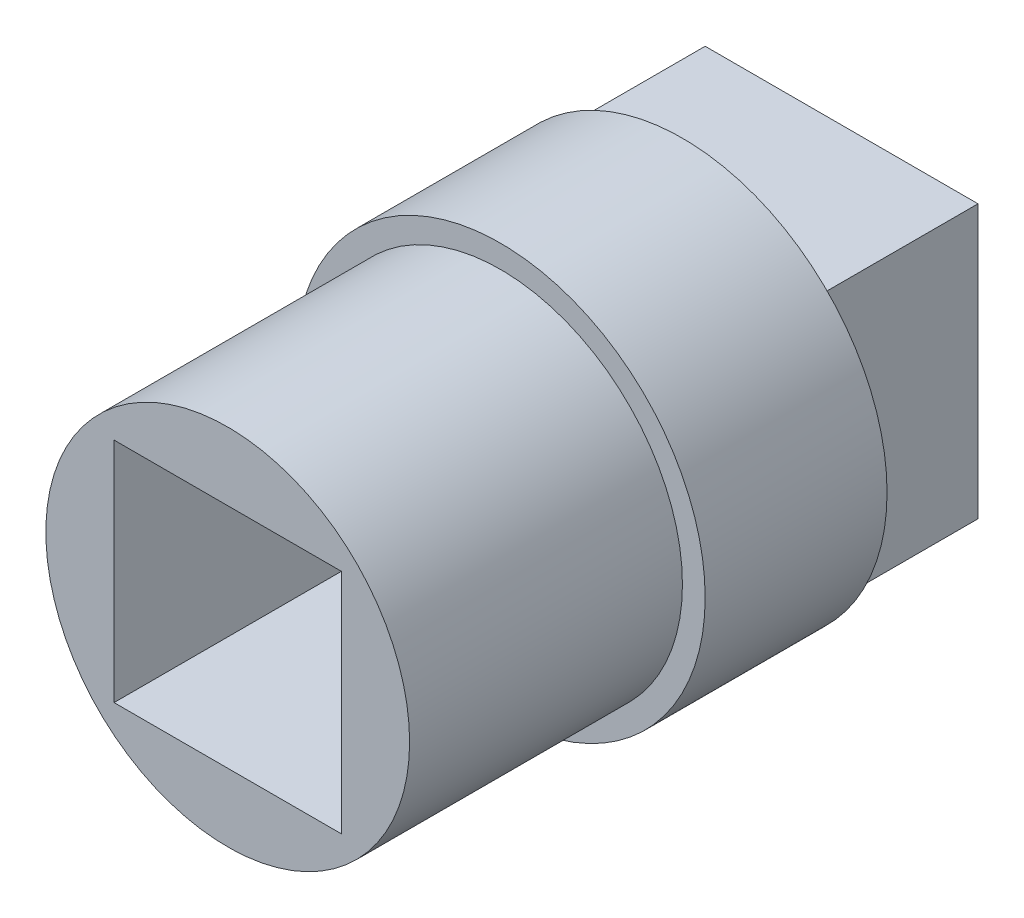
ISO-10303-21;
HEADER;
FILE_DESCRIPTION(('STEP AP214'),'2;1');
FILE_NAME('part.step','',(''),(''),'','','');
FILE_SCHEMA(('AUTOMOTIVE_DESIGN { 1 0 10303 214 1 1 1 1 }'));
ENDSEC;
DATA;
#1=APPLICATION_CONTEXT('core data for automotive mechanical design processes');
#2=APPLICATION_PROTOCOL_DEFINITION('international standard','automotive_design',2000,#1);
#3=PRODUCT_CONTEXT('',#1,'mechanical');
#4=PRODUCT('Part','Part','',(#3));
#5=PRODUCT_RELATED_PRODUCT_CATEGORY('part','',(#4));
#6=PRODUCT_DEFINITION_FORMATION('','',#4);
#7=PRODUCT_DEFINITION_CONTEXT('part definition',#1,'design');
#8=PRODUCT_DEFINITION('design','',#6,#7);
#9=PRODUCT_DEFINITION_SHAPE('','',#8);
#10=(LENGTH_UNIT() NAMED_UNIT(*) SI_UNIT(.MILLI.,.METRE.));
#11=(NAMED_UNIT(*) PLANE_ANGLE_UNIT() SI_UNIT($,.RADIAN.));
#12=(NAMED_UNIT(*) SI_UNIT($,.STERADIAN.) SOLID_ANGLE_UNIT());
#13=UNCERTAINTY_MEASURE_WITH_UNIT(LENGTH_MEASURE(1.E-05),#10,'distance_accuracy_value','');
#14=(GEOMETRIC_REPRESENTATION_CONTEXT(3) GLOBAL_UNCERTAINTY_ASSIGNED_CONTEXT((#13)) GLOBAL_UNIT_ASSIGNED_CONTEXT((#10,
#11,#12)) REPRESENTATION_CONTEXT('',''));
#15=CARTESIAN_POINT('',(0.,0.,0.));
#16=DIRECTION('',(0.,0.,1.));
#17=DIRECTION('',(1.,0.,0.));
#18=AXIS2_PLACEMENT_3D('',#15,#16,#17);
#19=CARTESIAN_POINT('',(3.,-3.,3.5));
#20=DIRECTION('',(-1.,0.,0.));
#21=DIRECTION('',(0.,0.,1.));
#22=AXIS2_PLACEMENT_3D('',#19,#20,#21);
#23=PLANE('',#22);
#24=DIRECTION('',(0.,1.,0.));
#25=VECTOR('',#24,1.);
#26=CARTESIAN_POINT('',(3.,-3.,0.));
#27=LINE('',#26,#25);
#28=CARTESIAN_POINT('',(3.,-3.,0.));
#29=VERTEX_POINT('',#28);
#30=CARTESIAN_POINT('',(3.,3.,0.));
#31=VERTEX_POINT('',#30);
#32=EDGE_CURVE('E157',#29,#31,#27,.T.);
#33=ORIENTED_EDGE('',*,*,#32,.T.);
#34=DIRECTION('',(0.,0.,-1.));
#35=VECTOR('',#34,1.);
#36=CARTESIAN_POINT('',(3.,3.,3.5));
#37=LINE('',#36,#35);
#38=CARTESIAN_POINT('',(3.,3.,3.5));
#39=VERTEX_POINT('',#38);
#40=EDGE_CURVE('E39',#39,#31,#37,.T.);
#41=ORIENTED_EDGE('',*,*,#40,.F.);
#42=DIRECTION('',(0.,1.,0.));
#43=VECTOR('',#42,1.);
#44=CARTESIAN_POINT('',(3.,-3.,3.5));
#45=LINE('',#44,#43);
#46=CARTESIAN_POINT('',(3.,-3.,3.5));
#47=VERTEX_POINT('',#46);
#48=EDGE_CURVE('E160',#47,#39,#45,.T.);
#49=ORIENTED_EDGE('',*,*,#48,.F.);
#50=DIRECTION('',(0.,0.,-1.));
#51=VECTOR('',#50,1.);
#52=CARTESIAN_POINT('',(3.,-3.,3.5));
#53=LINE('',#52,#51);
#54=EDGE_CURVE('E170',#47,#29,#53,.T.);
#55=ORIENTED_EDGE('',*,*,#54,.T.);
#56=EDGE_LOOP('',(#33,#41,#49,#55));
#57=FACE_BOUND('',#56,.T.);
#58=ADVANCED_FACE('F36',(#57),#23,.F.);
#59=CARTESIAN_POINT('',(-3.,3.,3.5));
#60=DIRECTION('',(0.,-1.,0.));
#61=DIRECTION('',(0.,0.,-1.));
#62=AXIS2_PLACEMENT_3D('',#59,#60,#61);
#63=PLANE('',#62);
#64=DIRECTION('',(-1.,0.,0.));
#65=VECTOR('',#64,1.);
#66=CARTESIAN_POINT('',(-3.,3.,0.));
#67=LINE('',#66,#65);
#68=CARTESIAN_POINT('',(-3.,3.,0.));
#69=VERTEX_POINT('',#68);
#70=EDGE_CURVE('E173',#31,#69,#67,.T.);
#71=ORIENTED_EDGE('',*,*,#70,.T.);
#72=DIRECTION('',(0.,0.,-1.));
#73=VECTOR('',#72,1.);
#74=CARTESIAN_POINT('',(-3.,3.,3.5));
#75=LINE('',#74,#73);
#76=CARTESIAN_POINT('',(-3.,3.,3.5));
#77=VERTEX_POINT('',#76);
#78=EDGE_CURVE('E179',#77,#69,#75,.T.);
#79=ORIENTED_EDGE('',*,*,#78,.F.);
#80=DIRECTION('',(-1.,0.,0.));
#81=VECTOR('',#80,1.);
#82=CARTESIAN_POINT('',(-3.,3.,3.5));
#83=LINE('',#82,#81);
#84=EDGE_CURVE('E86',#39,#77,#83,.T.);
#85=ORIENTED_EDGE('',*,*,#84,.F.);
#86=ORIENTED_EDGE('',*,*,#40,.T.);
#87=EDGE_LOOP('',(#71,#79,#85,#86));
#88=FACE_BOUND('',#87,.T.);
#89=ADVANCED_FACE('F182',(#88),#63,.F.);
#90=CARTESIAN_POINT('',(-3.,-3.,3.5));
#91=DIRECTION('',(1.,0.,0.));
#92=DIRECTION('',(0.,0.,-1.));
#93=AXIS2_PLACEMENT_3D('',#90,#91,#92);
#94=PLANE('',#93);
#95=DIRECTION('',(0.,-1.,0.));
#96=VECTOR('',#95,1.);
#97=CARTESIAN_POINT('',(-3.,-3.,0.));
#98=LINE('',#97,#96);
#99=CARTESIAN_POINT('',(-3.,-3.,0.));
#100=VERTEX_POINT('',#99);
#101=EDGE_CURVE('E175',#69,#100,#98,.T.);
#102=ORIENTED_EDGE('',*,*,#101,.T.);
#103=DIRECTION('',(0.,0.,-1.));
#104=VECTOR('',#103,1.);
#105=CARTESIAN_POINT('',(-3.,-3.,3.5));
#106=LINE('',#105,#104);
#107=CARTESIAN_POINT('',(-3.,-3.,3.5));
#108=VERTEX_POINT('',#107);
#109=EDGE_CURVE('E60',#108,#100,#106,.T.);
#110=ORIENTED_EDGE('',*,*,#109,.F.);
#111=DIRECTION('',(0.,-1.,0.));
#112=VECTOR('',#111,1.);
#113=CARTESIAN_POINT('',(-3.,-3.,3.5));
#114=LINE('',#113,#112);
#115=EDGE_CURVE('E164',#77,#108,#114,.T.);
#116=ORIENTED_EDGE('',*,*,#115,.F.);
#117=ORIENTED_EDGE('',*,*,#78,.T.);
#118=EDGE_LOOP('',(#102,#110,#116,#117));
#119=FACE_BOUND('',#118,.T.);
#120=ADVANCED_FACE('F187',(#119),#94,.F.);
#121=CARTESIAN_POINT('',(-3.,-3.,3.5));
#122=DIRECTION('',(0.,1.,0.));
#123=DIRECTION('',(0.,0.,1.));
#124=AXIS2_PLACEMENT_3D('',#121,#122,#123);
#125=PLANE('',#124);
#126=DIRECTION('',(1.,0.,0.));
#127=VECTOR('',#126,1.);
#128=CARTESIAN_POINT('',(-3.,-3.,0.));
#129=LINE('',#128,#127);
#130=EDGE_CURVE('E80',#100,#29,#129,.T.);
#131=ORIENTED_EDGE('',*,*,#130,.T.);
#132=ORIENTED_EDGE('',*,*,#54,.F.);
#133=DIRECTION('',(1.,0.,0.));
#134=VECTOR('',#133,1.);
#135=CARTESIAN_POINT('',(-3.,-3.,3.5));
#136=LINE('',#135,#134);
#137=EDGE_CURVE('E167',#108,#47,#136,.T.);
#138=ORIENTED_EDGE('',*,*,#137,.F.);
#139=ORIENTED_EDGE('',*,*,#109,.T.);
#140=EDGE_LOOP('',(#131,#132,#138,#139));
#141=FACE_BOUND('',#140,.T.);
#142=ADVANCED_FACE('F188',(#141),#125,.F.);
#143=CARTESIAN_POINT('',(0.,0.,0.));
#144=DIRECTION('',(0.,0.,-1.));
#145=DIRECTION('',(-1.,0.,0.));
#146=AXIS2_PLACEMENT_3D('',#143,#144,#145);
#147=PLANE('',#146);
#148=ORIENTED_EDGE('',*,*,#32,.F.);
#149=ORIENTED_EDGE('',*,*,#130,.F.);
#150=ORIENTED_EDGE('',*,*,#101,.F.);
#151=ORIENTED_EDGE('',*,*,#70,.F.);
#152=EDGE_LOOP('',(#148,#149,#150,#151));
#153=FACE_BOUND('',#152,.T.);
#154=ADVANCED_FACE('F186',(#153),#147,.T.);
#155=CARTESIAN_POINT('',(0.,0.,3.5));
#156=DIRECTION('',(0.,0.,1.));
#157=DIRECTION('',(1.,0.,0.));
#158=AXIS2_PLACEMENT_3D('',#155,#156,#157);
#159=PLANE('',#158);
#160=CARTESIAN_POINT('',(0.,0.,3.5));
#161=DIRECTION('',(0.,0.,1.));
#162=DIRECTION('',(1.,0.,0.));
#163=AXIS2_PLACEMENT_3D('',#160,#161,#162);
#164=CIRCLE('',#163,4.5);
#165=CARTESIAN_POINT('',(4.5,0.,3.5));
#166=VERTEX_POINT('',#165);
#167=EDGE_CURVE('E152',#166,#166,#164,.T.);
#168=ORIENTED_EDGE('',*,*,#167,.F.);
#169=EDGE_LOOP('',(#168));
#170=FACE_BOUND('',#169,.T.);
#171=ORIENTED_EDGE('',*,*,#137,.T.);
#172=ORIENTED_EDGE('',*,*,#48,.T.);
#173=ORIENTED_EDGE('',*,*,#84,.T.);
#174=ORIENTED_EDGE('',*,*,#115,.T.);
#175=EDGE_LOOP('',(#171,#172,#173,#174));
#176=FACE_BOUND('',#175,.T.);
#177=ADVANCED_FACE('F190',(#170,#176),#159,.F.);
#178=CARTESIAN_POINT('',(0.,0.,7.5));
#179=DIRECTION('',(0.,0.,-1.));
#180=DIRECTION('',(-1.,0.,0.));
#181=AXIS2_PLACEMENT_3D('',#178,#179,#180);
#182=CYLINDRICAL_SURFACE('',#181,4.5);
#183=CARTESIAN_POINT('',(0.,0.,7.5));
#184=DIRECTION('',(0.,0.,1.));
#185=DIRECTION('',(1.,0.,0.));
#186=AXIS2_PLACEMENT_3D('',#183,#184,#185);
#187=CIRCLE('',#186,4.5);
#188=CARTESIAN_POINT('',(4.5,0.,7.5));
#189=VERTEX_POINT('',#188);
#190=EDGE_CURVE('E154',#189,#189,#187,.T.);
#191=ORIENTED_EDGE('',*,*,#190,.F.);
#192=EDGE_LOOP('',(#191));
#193=FACE_BOUND('',#192,.T.);
#194=ORIENTED_EDGE('',*,*,#167,.T.);
#195=EDGE_LOOP('',(#194));
#196=FACE_BOUND('',#195,.T.);
#197=ADVANCED_FACE('F192',(#193,#196),#182,.T.);
#198=CARTESIAN_POINT('',(0.,0.,7.5));
#199=DIRECTION('',(0.,0.,1.));
#200=DIRECTION('',(1.,0.,0.));
#201=AXIS2_PLACEMENT_3D('',#198,#199,#200);
#202=PLANE('',#201);
#203=CARTESIAN_POINT('',(0.,0.,7.5));
#204=DIRECTION('',(0.,0.,1.));
#205=DIRECTION('',(1.,0.,0.));
#206=AXIS2_PLACEMENT_3D('',#203,#204,#205);
#207=CIRCLE('',#206,4.);
#208=CARTESIAN_POINT('',(4.,0.,7.5));
#209=VERTEX_POINT('',#208);
#210=EDGE_CURVE('E11',#209,#209,#207,.T.);
#211=ORIENTED_EDGE('',*,*,#210,.F.);
#212=EDGE_LOOP('',(#211));
#213=FACE_BOUND('',#212,.T.);
#214=ORIENTED_EDGE('',*,*,#190,.T.);
#215=EDGE_LOOP('',(#214));
#216=FACE_BOUND('',#215,.T.);
#217=ADVANCED_FACE('F199',(#213,#216),#202,.T.);
#218=CARTESIAN_POINT('',(0.,0.,13.5));
#219=DIRECTION('',(0.,0.,-1.));
#220=DIRECTION('',(-1.,0.,0.));
#221=AXIS2_PLACEMENT_3D('',#218,#219,#220);
#222=CYLINDRICAL_SURFACE('',#221,4.);
#223=CARTESIAN_POINT('',(0.,0.,13.5));
#224=DIRECTION('',(0.,0.,1.));
#225=DIRECTION('',(1.,0.,0.));
#226=AXIS2_PLACEMENT_3D('',#223,#224,#225);
#227=CIRCLE('',#226,4.);
#228=CARTESIAN_POINT('',(4.,0.,13.5));
#229=VERTEX_POINT('',#228);
#230=EDGE_CURVE('E147',#229,#229,#227,.T.);
#231=ORIENTED_EDGE('',*,*,#230,.F.);
#232=EDGE_LOOP('',(#231));
#233=FACE_BOUND('',#232,.T.);
#234=ORIENTED_EDGE('',*,*,#210,.T.);
#235=EDGE_LOOP('',(#234));
#236=FACE_BOUND('',#235,.T.);
#237=ADVANCED_FACE('F265',(#233,#236),#222,.T.);
#238=CARTESIAN_POINT('',(0.,0.,13.5));
#239=DIRECTION('',(0.,0.,1.));
#240=DIRECTION('',(1.,0.,0.));
#241=AXIS2_PLACEMENT_3D('',#238,#239,#240);
#242=PLANE('',#241);
#243=DIRECTION('',(0.,1.,0.));
#244=VECTOR('',#243,1.);
#245=CARTESIAN_POINT('',(2.5,-2.5,13.5));
#246=LINE('',#245,#244);
#247=CARTESIAN_POINT('',(2.5,-2.5,13.5));
#248=VERTEX_POINT('',#247);
#249=CARTESIAN_POINT('',(2.5,2.5,13.5));
#250=VERTEX_POINT('',#249);
#251=EDGE_CURVE('E51',#248,#250,#246,.T.);
#252=ORIENTED_EDGE('',*,*,#251,.F.);
#253=DIRECTION('',(1.,0.,0.));
#254=VECTOR('',#253,1.);
#255=CARTESIAN_POINT('',(-2.5,-2.5,13.5));
#256=LINE('',#255,#254);
#257=CARTESIAN_POINT('',(-2.5,-2.5,13.5));
#258=VERTEX_POINT('',#257);
#259=EDGE_CURVE('E132',#258,#248,#256,.T.);
#260=ORIENTED_EDGE('',*,*,#259,.F.);
#261=DIRECTION('',(0.,-1.,0.));
#262=VECTOR('',#261,1.);
#263=CARTESIAN_POINT('',(-2.5,-2.5,13.5));
#264=LINE('',#263,#262);
#265=CARTESIAN_POINT('',(-2.5,2.5,13.5));
#266=VERTEX_POINT('',#265);
#267=EDGE_CURVE('E135',#266,#258,#264,.T.);
#268=ORIENTED_EDGE('',*,*,#267,.F.);
#269=DIRECTION('',(-1.,0.,0.));
#270=VECTOR('',#269,1.);
#271=CARTESIAN_POINT('',(-2.5,2.5,13.5));
#272=LINE('',#271,#270);
#273=EDGE_CURVE('E141',#250,#266,#272,.T.);
#274=ORIENTED_EDGE('',*,*,#273,.F.);
#275=EDGE_LOOP('',(#252,#260,#268,#274));
#276=FACE_BOUND('',#275,.T.);
#277=ORIENTED_EDGE('',*,*,#230,.T.);
#278=EDGE_LOOP('',(#277));
#279=FACE_BOUND('',#278,.T.);
#280=ADVANCED_FACE('F274',(#276,#279),#242,.T.);
#281=CARTESIAN_POINT('',(2.5,-2.5,8.5));
#282=DIRECTION('',(1.,0.,0.));
#283=DIRECTION('',(0.,0.,-1.));
#284=AXIS2_PLACEMENT_3D('',#281,#282,#283);
#285=PLANE('',#284);
#286=ORIENTED_EDGE('',*,*,#251,.T.);
#287=DIRECTION('',(0.,0.,1.));
#288=VECTOR('',#287,1.);
#289=CARTESIAN_POINT('',(2.5,2.5,8.5));
#290=LINE('',#289,#288);
#291=CARTESIAN_POINT('',(2.5,2.5,8.5));
#292=VERTEX_POINT('',#291);
#293=EDGE_CURVE('E110',#292,#250,#290,.T.);
#294=ORIENTED_EDGE('',*,*,#293,.F.);
#295=DIRECTION('',(0.,1.,0.));
#296=VECTOR('',#295,1.);
#297=CARTESIAN_POINT('',(2.5,-2.5,8.5));
#298=LINE('',#297,#296);
#299=CARTESIAN_POINT('',(2.5,-2.5,8.5));
#300=VERTEX_POINT('',#299);
#301=EDGE_CURVE('E114',#300,#292,#298,.T.);
#302=ORIENTED_EDGE('',*,*,#301,.F.);
#303=DIRECTION('',(0.,0.,1.));
#304=VECTOR('',#303,1.);
#305=CARTESIAN_POINT('',(2.5,-2.5,8.5));
#306=LINE('',#305,#304);
#307=EDGE_CURVE('E145',#300,#248,#306,.T.);
#308=ORIENTED_EDGE('',*,*,#307,.T.);
#309=EDGE_LOOP('',(#286,#294,#302,#308));
#310=FACE_BOUND('',#309,.T.);
#311=ADVANCED_FACE('F112',(#310),#285,.F.);
#312=CARTESIAN_POINT('',(-2.5,-2.5,8.5));
#313=DIRECTION('',(0.,-1.,0.));
#314=DIRECTION('',(0.,0.,-1.));
#315=AXIS2_PLACEMENT_3D('',#312,#313,#314);
#316=PLANE('',#315);
#317=ORIENTED_EDGE('',*,*,#259,.T.);
#318=ORIENTED_EDGE('',*,*,#307,.F.);
#319=DIRECTION('',(1.,0.,0.));
#320=VECTOR('',#319,1.);
#321=CARTESIAN_POINT('',(-2.5,-2.5,8.5));
#322=LINE('',#321,#320);
#323=CARTESIAN_POINT('',(-2.5,-2.5,8.5));
#324=VERTEX_POINT('',#323);
#325=EDGE_CURVE('E120',#324,#300,#322,.T.);
#326=ORIENTED_EDGE('',*,*,#325,.F.);
#327=DIRECTION('',(0.,0.,1.));
#328=VECTOR('',#327,1.);
#329=CARTESIAN_POINT('',(-2.5,-2.5,8.5));
#330=LINE('',#329,#328);
#331=EDGE_CURVE('E148',#324,#258,#330,.T.);
#332=ORIENTED_EDGE('',*,*,#331,.T.);
#333=EDGE_LOOP('',(#317,#318,#326,#332));
#334=FACE_BOUND('',#333,.T.);
#335=ADVANCED_FACE('F293',(#334),#316,.F.);
#336=CARTESIAN_POINT('',(-2.5,-2.5,8.5));
#337=DIRECTION('',(-1.,0.,0.));
#338=DIRECTION('',(0.,0.,1.));
#339=AXIS2_PLACEMENT_3D('',#336,#337,#338);
#340=PLANE('',#339);
#341=ORIENTED_EDGE('',*,*,#267,.T.);
#342=ORIENTED_EDGE('',*,*,#331,.F.);
#343=DIRECTION('',(0.,-1.,0.));
#344=VECTOR('',#343,1.);
#345=CARTESIAN_POINT('',(-2.5,-2.5,8.5));
#346=LINE('',#345,#344);
#347=CARTESIAN_POINT('',(-2.5,2.5,8.5));
#348=VERTEX_POINT('',#347);
#349=EDGE_CURVE('E128',#348,#324,#346,.T.);
#350=ORIENTED_EDGE('',*,*,#349,.F.);
#351=DIRECTION('',(0.,0.,1.));
#352=VECTOR('',#351,1.);
#353=CARTESIAN_POINT('',(-2.5,2.5,8.5));
#354=LINE('',#353,#352);
#355=EDGE_CURVE('E119',#348,#266,#354,.T.);
#356=ORIENTED_EDGE('',*,*,#355,.T.);
#357=EDGE_LOOP('',(#341,#342,#350,#356));
#358=FACE_BOUND('',#357,.T.);
#359=ADVANCED_FACE('F302',(#358),#340,.F.);
#360=CARTESIAN_POINT('',(-2.5,2.5,8.5));
#361=DIRECTION('',(0.,1.,0.));
#362=DIRECTION('',(0.,0.,1.));
#363=AXIS2_PLACEMENT_3D('',#360,#361,#362);
#364=PLANE('',#363);
#365=ORIENTED_EDGE('',*,*,#273,.T.);
#366=ORIENTED_EDGE('',*,*,#355,.F.);
#367=DIRECTION('',(-1.,0.,0.));
#368=VECTOR('',#367,1.);
#369=CARTESIAN_POINT('',(-2.5,2.5,8.5));
#370=LINE('',#369,#368);
#371=EDGE_CURVE('E123',#292,#348,#370,.T.);
#372=ORIENTED_EDGE('',*,*,#371,.F.);
#373=ORIENTED_EDGE('',*,*,#293,.T.);
#374=EDGE_LOOP('',(#365,#366,#372,#373));
#375=FACE_BOUND('',#374,.T.);
#376=ADVANCED_FACE('F124',(#375),#364,.F.);
#377=CARTESIAN_POINT('',(0.,0.,8.5));
#378=DIRECTION('',(0.,0.,-1.));
#379=DIRECTION('',(-1.,0.,0.));
#380=AXIS2_PLACEMENT_3D('',#377,#378,#379);
#381=PLANE('',#380);
#382=ORIENTED_EDGE('',*,*,#301,.T.);
#383=ORIENTED_EDGE('',*,*,#371,.T.);
#384=ORIENTED_EDGE('',*,*,#349,.T.);
#385=ORIENTED_EDGE('',*,*,#325,.T.);
#386=EDGE_LOOP('',(#382,#383,#384,#385));
#387=FACE_BOUND('',#386,.T.);
#388=ADVANCED_FACE('F130',(#387),#381,.F.);
#389=CLOSED_SHELL('',(#58,#89,#120,#142,#154,#177,#197,#217,#237,#280,#311,#335,#359,#376,#388));
#390=MANIFOLD_SOLID_BREP('B2',#389);
#391=ADVANCED_BREP_SHAPE_REPRESENTATION('',(#18,#390),#14);
#392=SHAPE_DEFINITION_REPRESENTATION(#9,#391);
ENDSEC;
END-ISO-10303-21;
